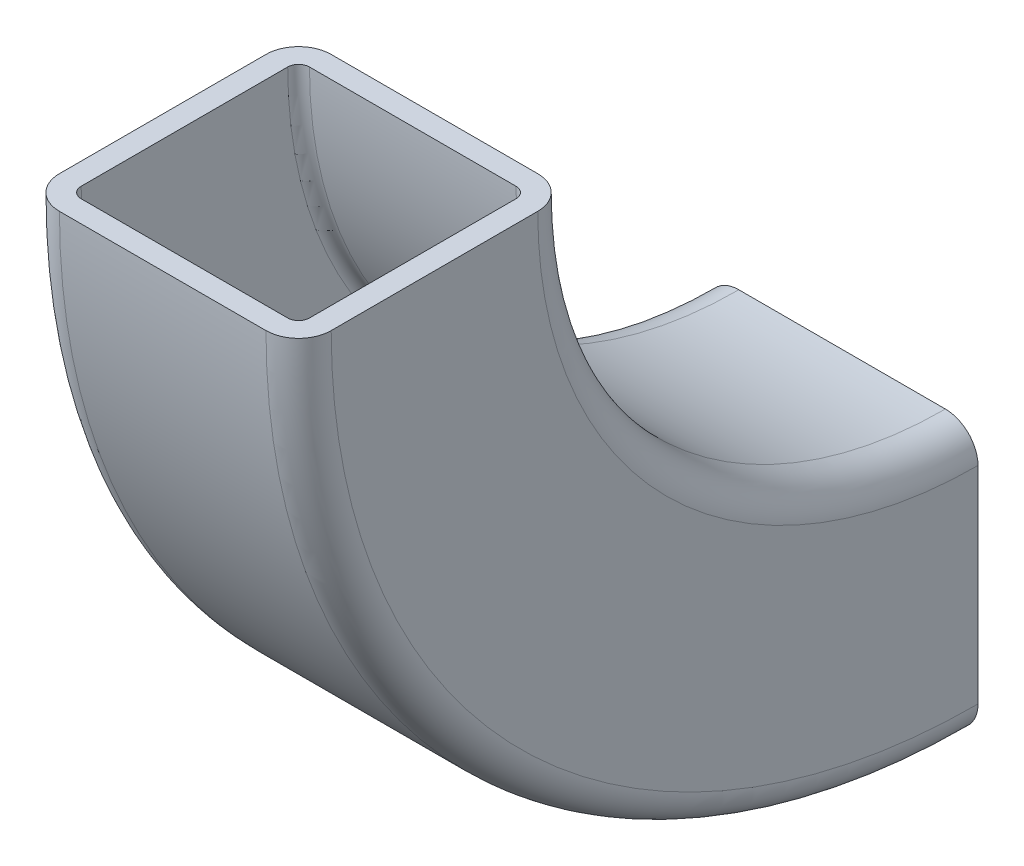
ISO-10303-21;
HEADER;
FILE_DESCRIPTION(('STEP AP214'),'2;1');
FILE_NAME('part.step','',(''),(''),'','','');
FILE_SCHEMA(('AUTOMOTIVE_DESIGN { 1 0 10303 214 1 1 1 1 }'));
ENDSEC;
DATA;
#1=APPLICATION_CONTEXT('core data for automotive mechanical design processes');
#2=APPLICATION_PROTOCOL_DEFINITION('international standard','automotive_design',2000,#1);
#3=PRODUCT_CONTEXT('',#1,'mechanical');
#4=PRODUCT('Part','Part','',(#3));
#5=PRODUCT_RELATED_PRODUCT_CATEGORY('part','',(#4));
#6=PRODUCT_DEFINITION_FORMATION('','',#4);
#7=PRODUCT_DEFINITION_CONTEXT('part definition',#1,'design');
#8=PRODUCT_DEFINITION('design','',#6,#7);
#9=PRODUCT_DEFINITION_SHAPE('','',#8);
#10=(LENGTH_UNIT() NAMED_UNIT(*) SI_UNIT(.MILLI.,.METRE.));
#11=(NAMED_UNIT(*) PLANE_ANGLE_UNIT() SI_UNIT($,.RADIAN.));
#12=(NAMED_UNIT(*) SI_UNIT($,.STERADIAN.) SOLID_ANGLE_UNIT());
#13=UNCERTAINTY_MEASURE_WITH_UNIT(LENGTH_MEASURE(1.E-05),#10,'distance_accuracy_value','');
#14=(GEOMETRIC_REPRESENTATION_CONTEXT(3) GLOBAL_UNCERTAINTY_ASSIGNED_CONTEXT((#13)) GLOBAL_UNIT_ASSIGNED_CONTEXT((#10,
#11,#12)) REPRESENTATION_CONTEXT('',''));
#15=CARTESIAN_POINT('',(0.,0.,0.));
#16=DIRECTION('',(0.,0.,1.));
#17=DIRECTION('',(1.,0.,0.));
#18=AXIS2_PLACEMENT_3D('',#15,#16,#17);
#19=CARTESIAN_POINT('',(0.,0.,0.));
#20=DIRECTION('',(0.,0.,1.));
#21=DIRECTION('',(1.,0.,0.));
#22=AXIS2_PLACEMENT_3D('',#19,#20,#21);
#23=PLANE('',#22);
#24=CARTESIAN_POINT('',(-9.5,-9.5,0.));
#25=DIRECTION('',(0.,0.,-1.));
#26=DIRECTION('',(1.,0.,0.));
#27=AXIS2_PLACEMENT_3D('',#24,#25,#26);
#28=CIRCLE('',#27,3.);
#29=CARTESIAN_POINT('',(-9.5,-12.5,0.));
#30=VERTEX_POINT('',#29);
#31=CARTESIAN_POINT('',(-12.5,-9.5,0.));
#32=VERTEX_POINT('',#31);
#33=EDGE_CURVE('E26',#30,#32,#28,.T.);
#34=ORIENTED_EDGE('',*,*,#33,.T.);
#35=DIRECTION('',(0.,1.,0.));
#36=VECTOR('',#35,1.);
#37=CARTESIAN_POINT('',(-12.5,-9.5,0.));
#38=LINE('',#37,#36);
#39=CARTESIAN_POINT('',(-12.5,9.5,0.));
#40=VERTEX_POINT('',#39);
#41=EDGE_CURVE('E184',#32,#40,#38,.T.);
#42=ORIENTED_EDGE('',*,*,#41,.T.);
#43=CARTESIAN_POINT('',(-9.5,9.5,0.));
#44=DIRECTION('',(0.,0.,-1.));
#45=DIRECTION('',(0.,-1.,0.));
#46=AXIS2_PLACEMENT_3D('',#43,#44,#45);
#47=CIRCLE('',#46,3.);
#48=CARTESIAN_POINT('',(-9.5,12.5,0.));
#49=VERTEX_POINT('',#48);
#50=EDGE_CURVE('E177',#40,#49,#47,.T.);
#51=ORIENTED_EDGE('',*,*,#50,.T.);
#52=DIRECTION('',(1.,0.,0.));
#53=VECTOR('',#52,1.);
#54=CARTESIAN_POINT('',(-9.5,12.5,0.));
#55=LINE('',#54,#53);
#56=CARTESIAN_POINT('',(9.5,12.5,0.));
#57=VERTEX_POINT('',#56);
#58=EDGE_CURVE('E160',#49,#57,#55,.T.);
#59=ORIENTED_EDGE('',*,*,#58,.T.);
#60=CARTESIAN_POINT('',(9.5,9.5,0.));
#61=DIRECTION('',(0.,0.,-1.));
#62=DIRECTION('',(-1.,0.,0.));
#63=AXIS2_PLACEMENT_3D('',#60,#61,#62);
#64=CIRCLE('',#63,3.);
#65=CARTESIAN_POINT('',(12.5,9.5,0.));
#66=VERTEX_POINT('',#65);
#67=EDGE_CURVE('E289',#57,#66,#64,.T.);
#68=ORIENTED_EDGE('',*,*,#67,.T.);
#69=DIRECTION('',(0.,-1.,0.));
#70=VECTOR('',#69,1.);
#71=CARTESIAN_POINT('',(12.5,9.5,0.));
#72=LINE('',#71,#70);
#73=CARTESIAN_POINT('',(12.5,-9.5,0.));
#74=VERTEX_POINT('',#73);
#75=EDGE_CURVE('E204',#66,#74,#72,.T.);
#76=ORIENTED_EDGE('',*,*,#75,.T.);
#77=CARTESIAN_POINT('',(9.5,-9.5,0.));
#78=DIRECTION('',(0.,0.,-1.));
#79=DIRECTION('',(0.,1.,0.));
#80=AXIS2_PLACEMENT_3D('',#77,#78,#79);
#81=CIRCLE('',#80,3.);
#82=CARTESIAN_POINT('',(9.5,-12.5,0.));
#83=VERTEX_POINT('',#82);
#84=EDGE_CURVE('E205',#74,#83,#81,.T.);
#85=ORIENTED_EDGE('',*,*,#84,.T.);
#86=DIRECTION('',(-1.,0.,0.));
#87=VECTOR('',#86,1.);
#88=CARTESIAN_POINT('',(9.5,-12.5,0.));
#89=LINE('',#88,#87);
#90=EDGE_CURVE('E235',#83,#30,#89,.T.);
#91=ORIENTED_EDGE('',*,*,#90,.T.);
#92=EDGE_LOOP('',(#34,#42,#51,#59,#68,#76,#85,#91));
#93=FACE_BOUND('',#92,.T.);
#94=DIRECTION('',(-1.,0.,0.));
#95=VECTOR('',#94,1.);
#96=CARTESIAN_POINT('',(0.,10.5,0.));
#97=LINE('',#96,#95);
#98=CARTESIAN_POINT('',(9.5,10.5,0.));
#99=VERTEX_POINT('',#98);
#100=CARTESIAN_POINT('',(-9.5,10.5,0.));
#101=VERTEX_POINT('',#100);
#102=EDGE_CURVE('E220',#99,#101,#97,.T.);
#103=ORIENTED_EDGE('',*,*,#102,.T.);
#104=CARTESIAN_POINT('',(-9.5,9.5,0.));
#105=DIRECTION('',(0.,0.,1.));
#106=DIRECTION('',(0.,-1.,0.));
#107=AXIS2_PLACEMENT_3D('',#104,#105,#106);
#108=CIRCLE('',#107,1.);
#109=CARTESIAN_POINT('',(-10.5,9.5,0.));
#110=VERTEX_POINT('',#109);
#111=EDGE_CURVE('E226',#101,#110,#108,.T.);
#112=ORIENTED_EDGE('',*,*,#111,.T.);
#113=DIRECTION('',(0.,-1.,0.));
#114=VECTOR('',#113,1.);
#115=CARTESIAN_POINT('',(-10.5,4.75,0.));
#116=LINE('',#115,#114);
#117=CARTESIAN_POINT('',(-10.5,-9.5,0.));
#118=VERTEX_POINT('',#117);
#119=EDGE_CURVE('E114',#110,#118,#116,.T.);
#120=ORIENTED_EDGE('',*,*,#119,.T.);
#121=CARTESIAN_POINT('',(-9.5,-9.5,0.));
#122=DIRECTION('',(0.,0.,1.));
#123=DIRECTION('',(0.,-1.,0.));
#124=AXIS2_PLACEMENT_3D('',#121,#122,#123);
#125=CIRCLE('',#124,1.);
#126=CARTESIAN_POINT('',(-9.5,-10.5,0.));
#127=VERTEX_POINT('',#126);
#128=EDGE_CURVE('E210',#118,#127,#125,.T.);
#129=ORIENTED_EDGE('',*,*,#128,.T.);
#130=DIRECTION('',(1.,0.,0.));
#131=VECTOR('',#130,1.);
#132=CARTESIAN_POINT('',(0.,-10.5,0.));
#133=LINE('',#132,#131);
#134=CARTESIAN_POINT('',(9.5,-10.5,0.));
#135=VERTEX_POINT('',#134);
#136=EDGE_CURVE('E225',#127,#135,#133,.T.);
#137=ORIENTED_EDGE('',*,*,#136,.T.);
#138=CARTESIAN_POINT('',(9.5,-9.5,0.));
#139=DIRECTION('',(0.,0.,1.));
#140=DIRECTION('',(0.,-1.,0.));
#141=AXIS2_PLACEMENT_3D('',#138,#139,#140);
#142=CIRCLE('',#141,1.);
#143=CARTESIAN_POINT('',(10.5,-9.5,0.));
#144=VERTEX_POINT('',#143);
#145=EDGE_CURVE('E243',#135,#144,#142,.T.);
#146=ORIENTED_EDGE('',*,*,#145,.T.);
#147=DIRECTION('',(0.,1.,0.));
#148=VECTOR('',#147,1.);
#149=CARTESIAN_POINT('',(10.5,-4.75,0.));
#150=LINE('',#149,#148);
#151=CARTESIAN_POINT('',(10.5,9.5,0.));
#152=VERTEX_POINT('',#151);
#153=EDGE_CURVE('E247',#144,#152,#150,.T.);
#154=ORIENTED_EDGE('',*,*,#153,.T.);
#155=CARTESIAN_POINT('',(9.5,9.5,0.));
#156=DIRECTION('',(0.,0.,1.));
#157=DIRECTION('',(0.,-1.,0.));
#158=AXIS2_PLACEMENT_3D('',#155,#156,#157);
#159=CIRCLE('',#158,1.);
#160=EDGE_CURVE('E242',#152,#99,#159,.T.);
#161=ORIENTED_EDGE('',*,*,#160,.T.);
#162=EDGE_LOOP('',(#103,#112,#120,#129,#137,#146,#154,#161));
#163=FACE_BOUND('',#162,.T.);
#164=ADVANCED_FACE('F16',(#93,#163),#23,.F.);
#165=CARTESIAN_POINT('',(0.,50.,50.));
#166=DIRECTION('',(0.,1.,0.));
#167=DIRECTION('',(0.,0.,-1.));
#168=AXIS2_PLACEMENT_3D('',#165,#166,#167);
#169=PLANE('',#168);
#170=CARTESIAN_POINT('',(-9.5,50.,59.5));
#171=DIRECTION('',(0.,1.,0.));
#172=DIRECTION('',(1.,0.,0.));
#173=AXIS2_PLACEMENT_3D('',#170,#171,#172);
#174=CIRCLE('',#173,3.);
#175=CARTESIAN_POINT('',(-12.5,50.,59.5));
#176=VERTEX_POINT('',#175);
#177=CARTESIAN_POINT('',(-9.5,50.,62.5));
#178=VERTEX_POINT('',#177);
#179=EDGE_CURVE('E11',#176,#178,#174,.T.);
#180=ORIENTED_EDGE('',*,*,#179,.T.);
#181=DIRECTION('',(1.,0.,0.));
#182=VECTOR('',#181,1.);
#183=CARTESIAN_POINT('',(9.5,50.,62.5));
#184=LINE('',#183,#182);
#185=CARTESIAN_POINT('',(9.5,50.,62.5));
#186=VERTEX_POINT('',#185);
#187=EDGE_CURVE('E262',#178,#186,#184,.T.);
#188=ORIENTED_EDGE('',*,*,#187,.T.);
#189=CARTESIAN_POINT('',(9.5,50.,59.5));
#190=DIRECTION('',(0.,1.,0.));
#191=DIRECTION('',(0.,0.,-1.));
#192=AXIS2_PLACEMENT_3D('',#189,#190,#191);
#193=CIRCLE('',#192,3.);
#194=CARTESIAN_POINT('',(12.5,50.,59.5));
#195=VERTEX_POINT('',#194);
#196=EDGE_CURVE('E209',#186,#195,#193,.T.);
#197=ORIENTED_EDGE('',*,*,#196,.T.);
#198=DIRECTION('',(0.,0.,-1.));
#199=VECTOR('',#198,1.);
#200=CARTESIAN_POINT('',(12.5,50.,40.5));
#201=LINE('',#200,#199);
#202=CARTESIAN_POINT('',(12.5,50.,40.5));
#203=VERTEX_POINT('',#202);
#204=EDGE_CURVE('E200',#195,#203,#201,.T.);
#205=ORIENTED_EDGE('',*,*,#204,.T.);
#206=CARTESIAN_POINT('',(9.5,50.,40.5));
#207=DIRECTION('',(0.,1.,0.));
#208=DIRECTION('',(-1.,0.,0.));
#209=AXIS2_PLACEMENT_3D('',#206,#207,#208);
#210=CIRCLE('',#209,3.);
#211=CARTESIAN_POINT('',(9.5,50.,37.5));
#212=VERTEX_POINT('',#211);
#213=EDGE_CURVE('E270',#203,#212,#210,.T.);
#214=ORIENTED_EDGE('',*,*,#213,.T.);
#215=DIRECTION('',(-1.,0.,0.));
#216=VECTOR('',#215,1.);
#217=CARTESIAN_POINT('',(-9.5,50.,37.5));
#218=LINE('',#217,#216);
#219=CARTESIAN_POINT('',(-9.5,50.,37.5));
#220=VERTEX_POINT('',#219);
#221=EDGE_CURVE('E172',#212,#220,#218,.T.);
#222=ORIENTED_EDGE('',*,*,#221,.T.);
#223=CARTESIAN_POINT('',(-9.5,50.,40.5));
#224=DIRECTION('',(0.,1.,0.));
#225=DIRECTION('',(0.,0.,1.));
#226=AXIS2_PLACEMENT_3D('',#223,#224,#225);
#227=CIRCLE('',#226,3.);
#228=CARTESIAN_POINT('',(-12.5,50.,40.5));
#229=VERTEX_POINT('',#228);
#230=EDGE_CURVE('E179',#220,#229,#227,.T.);
#231=ORIENTED_EDGE('',*,*,#230,.T.);
#232=DIRECTION('',(0.,0.,1.));
#233=VECTOR('',#232,1.);
#234=CARTESIAN_POINT('',(-12.5,50.,59.5));
#235=LINE('',#234,#233);
#236=EDGE_CURVE('E194',#229,#176,#235,.T.);
#237=ORIENTED_EDGE('',*,*,#236,.T.);
#238=EDGE_LOOP('',(#180,#188,#197,#205,#214,#222,#231,#237));
#239=FACE_BOUND('',#238,.T.);
#240=DIRECTION('',(1.,0.,0.));
#241=VECTOR('',#240,1.);
#242=CARTESIAN_POINT('',(0.,50.,39.5));
#243=LINE('',#242,#241);
#244=CARTESIAN_POINT('',(-9.5,50.,39.5));
#245=VERTEX_POINT('',#244);
#246=CARTESIAN_POINT('',(9.5,50.,39.5));
#247=VERTEX_POINT('',#246);
#248=EDGE_CURVE('E219',#245,#247,#243,.T.);
#249=ORIENTED_EDGE('',*,*,#248,.T.);
#250=CARTESIAN_POINT('',(9.5,50.,40.5));
#251=DIRECTION('',(0.,-1.,0.));
#252=DIRECTION('',(0.,0.,1.));
#253=AXIS2_PLACEMENT_3D('',#250,#251,#252);
#254=CIRCLE('',#253,1.);
#255=CARTESIAN_POINT('',(10.5,50.,40.5));
#256=VERTEX_POINT('',#255);
#257=EDGE_CURVE('E251',#247,#256,#254,.T.);
#258=ORIENTED_EDGE('',*,*,#257,.T.);
#259=DIRECTION('',(0.,0.,1.));
#260=VECTOR('',#259,1.);
#261=CARTESIAN_POINT('',(10.5,50.,25.));
#262=LINE('',#261,#260);
#263=CARTESIAN_POINT('',(10.5,50.,59.5));
#264=VERTEX_POINT('',#263);
#265=EDGE_CURVE('E246',#256,#264,#262,.T.);
#266=ORIENTED_EDGE('',*,*,#265,.T.);
#267=CARTESIAN_POINT('',(9.5,50.,59.5));
#268=DIRECTION('',(0.,-1.,0.));
#269=DIRECTION('',(0.,0.,1.));
#270=AXIS2_PLACEMENT_3D('',#267,#268,#269);
#271=CIRCLE('',#270,1.);
#272=CARTESIAN_POINT('',(9.5,50.,60.5));
#273=VERTEX_POINT('',#272);
#274=EDGE_CURVE('E317',#264,#273,#271,.T.);
#275=ORIENTED_EDGE('',*,*,#274,.T.);
#276=DIRECTION('',(-1.,0.,0.));
#277=VECTOR('',#276,1.);
#278=CARTESIAN_POINT('',(0.,50.,60.5));
#279=LINE('',#278,#277);
#280=CARTESIAN_POINT('',(-9.5,50.,60.5));
#281=VERTEX_POINT('',#280);
#282=EDGE_CURVE('E214',#273,#281,#279,.T.);
#283=ORIENTED_EDGE('',*,*,#282,.T.);
#284=CARTESIAN_POINT('',(-9.5,50.,59.5));
#285=DIRECTION('',(0.,-1.,0.));
#286=DIRECTION('',(0.,0.,1.));
#287=AXIS2_PLACEMENT_3D('',#284,#285,#286);
#288=CIRCLE('',#287,1.);
#289=CARTESIAN_POINT('',(-10.5,50.,59.5));
#290=VERTEX_POINT('',#289);
#291=EDGE_CURVE('E126',#281,#290,#288,.T.);
#292=ORIENTED_EDGE('',*,*,#291,.T.);
#293=DIRECTION('',(0.,0.,-1.));
#294=VECTOR('',#293,1.);
#295=CARTESIAN_POINT('',(-10.5,50.,25.));
#296=LINE('',#295,#294);
#297=CARTESIAN_POINT('',(-10.5,50.,40.5));
#298=VERTEX_POINT('',#297);
#299=EDGE_CURVE('E229',#290,#298,#296,.T.);
#300=ORIENTED_EDGE('',*,*,#299,.T.);
#301=CARTESIAN_POINT('',(-9.5,50.,40.5));
#302=DIRECTION('',(0.,-1.,0.));
#303=DIRECTION('',(0.,0.,1.));
#304=AXIS2_PLACEMENT_3D('',#301,#302,#303);
#305=CIRCLE('',#304,1.);
#306=EDGE_CURVE('E228',#298,#245,#305,.T.);
#307=ORIENTED_EDGE('',*,*,#306,.T.);
#308=EDGE_LOOP('',(#249,#258,#266,#275,#283,#292,#300,#307));
#309=FACE_BOUND('',#308,.T.);
#310=ADVANCED_FACE('F351',(#239,#309),#169,.T.);
#311=CARTESIAN_POINT('',(-9.5,50.,0.));
#312=DIRECTION('',(-1.,0.,0.));
#313=DIRECTION('',(0.,0.,1.));
#314=AXIS2_PLACEMENT_3D('',#311,#312,#313);
#315=TOROIDAL_SURFACE('',#314,59.5,3.);
#316=ORIENTED_EDGE('',*,*,#33,.F.);
#317=CARTESIAN_POINT('',(-9.5,50.,0.));
#318=DIRECTION('',(-1.,0.,0.));
#319=DIRECTION('',(0.,-1.,0.));
#320=AXIS2_PLACEMENT_3D('',#317,#318,#319);
#321=CIRCLE('',#320,62.5);
#322=EDGE_CURVE('E265',#30,#178,#321,.T.);
#323=ORIENTED_EDGE('',*,*,#322,.T.);
#324=ORIENTED_EDGE('',*,*,#179,.F.);
#325=CARTESIAN_POINT('',(-12.5,50.,0.));
#326=DIRECTION('',(-1.,0.,0.));
#327=DIRECTION('',(0.,-1.,0.));
#328=AXIS2_PLACEMENT_3D('',#325,#326,#327);
#329=CIRCLE('',#328,59.5);
#330=EDGE_CURVE('E299',#32,#176,#329,.T.);
#331=ORIENTED_EDGE('',*,*,#330,.F.);
#332=EDGE_LOOP('',(#316,#323,#324,#331));
#333=FACE_BOUND('',#332,.T.);
#334=ADVANCED_FACE('F348',(#333),#315,.T.);
#335=CARTESIAN_POINT('',(0.,50.,0.));
#336=DIRECTION('',(-1.,0.,0.));
#337=DIRECTION('',(0.,-1.,0.));
#338=AXIS2_PLACEMENT_3D('',#335,#336,#337);
#339=CYLINDRICAL_SURFACE('',#338,62.5);
#340=ORIENTED_EDGE('',*,*,#90,.F.);
#341=CARTESIAN_POINT('',(9.5,50.,0.));
#342=DIRECTION('',(-1.,0.,0.));
#343=DIRECTION('',(0.,-1.,0.));
#344=AXIS2_PLACEMENT_3D('',#341,#342,#343);
#345=CIRCLE('',#344,62.5);
#346=EDGE_CURVE('E231',#83,#186,#345,.T.);
#347=ORIENTED_EDGE('',*,*,#346,.T.);
#348=ORIENTED_EDGE('',*,*,#187,.F.);
#349=ORIENTED_EDGE('',*,*,#322,.F.);
#350=EDGE_LOOP('',(#340,#347,#348,#349));
#351=FACE_BOUND('',#350,.T.);
#352=ADVANCED_FACE('F405',(#351),#339,.T.);
#353=CARTESIAN_POINT('',(9.5,50.,0.));
#354=DIRECTION('',(-1.,0.,0.));
#355=DIRECTION('',(0.,0.,1.));
#356=AXIS2_PLACEMENT_3D('',#353,#354,#355);
#357=TOROIDAL_SURFACE('',#356,59.5,3.);
#358=ORIENTED_EDGE('',*,*,#84,.F.);
#359=CARTESIAN_POINT('',(12.5,50.,0.));
#360=DIRECTION('',(-1.,0.,0.));
#361=DIRECTION('',(0.,-1.,0.));
#362=AXIS2_PLACEMENT_3D('',#359,#360,#361);
#363=CIRCLE('',#362,59.5);
#364=EDGE_CURVE('E203',#74,#195,#363,.T.);
#365=ORIENTED_EDGE('',*,*,#364,.T.);
#366=ORIENTED_EDGE('',*,*,#196,.F.);
#367=ORIENTED_EDGE('',*,*,#346,.F.);
#368=EDGE_LOOP('',(#358,#365,#366,#367));
#369=FACE_BOUND('',#368,.T.);
#370=ADVANCED_FACE('F419',(#369),#357,.T.);
#371=CARTESIAN_POINT('',(12.5,-9.5,0.));
#372=DIRECTION('',(1.,0.,0.));
#373=DIRECTION('',(0.,0.,1.));
#374=AXIS2_PLACEMENT_3D('',#371,#372,#373);
#375=PLANE('',#374);
#376=ORIENTED_EDGE('',*,*,#75,.F.);
#377=CARTESIAN_POINT('',(12.5,50.,0.));
#378=DIRECTION('',(-1.,0.,0.));
#379=DIRECTION('',(0.,-1.,0.));
#380=AXIS2_PLACEMENT_3D('',#377,#378,#379);
#381=CIRCLE('',#380,40.5);
#382=EDGE_CURVE('E266',#66,#203,#381,.T.);
#383=ORIENTED_EDGE('',*,*,#382,.T.);
#384=ORIENTED_EDGE('',*,*,#204,.F.);
#385=ORIENTED_EDGE('',*,*,#364,.F.);
#386=EDGE_LOOP('',(#376,#383,#384,#385));
#387=FACE_BOUND('',#386,.T.);
#388=ADVANCED_FACE('F409',(#387),#375,.T.);
#389=CARTESIAN_POINT('',(9.5,50.,0.));
#390=DIRECTION('',(-1.,0.,0.));
#391=DIRECTION('',(0.,0.,1.));
#392=AXIS2_PLACEMENT_3D('',#389,#390,#391);
#393=TOROIDAL_SURFACE('',#392,40.5,3.);
#394=ORIENTED_EDGE('',*,*,#67,.F.);
#395=CARTESIAN_POINT('',(9.5,50.,0.));
#396=DIRECTION('',(-1.,0.,0.));
#397=DIRECTION('',(0.,-1.,0.));
#398=AXIS2_PLACEMENT_3D('',#395,#396,#397);
#399=CIRCLE('',#398,37.5);
#400=EDGE_CURVE('E167',#57,#212,#399,.T.);
#401=ORIENTED_EDGE('',*,*,#400,.T.);
#402=ORIENTED_EDGE('',*,*,#213,.F.);
#403=ORIENTED_EDGE('',*,*,#382,.F.);
#404=EDGE_LOOP('',(#394,#401,#402,#403));
#405=FACE_BOUND('',#404,.T.);
#406=ADVANCED_FACE('F356',(#405),#393,.T.);
#407=CARTESIAN_POINT('',(0.,50.,0.));
#408=DIRECTION('',(-1.,0.,0.));
#409=DIRECTION('',(0.,-1.,0.));
#410=AXIS2_PLACEMENT_3D('',#407,#408,#409);
#411=CYLINDRICAL_SURFACE('',#410,37.5);
#412=ORIENTED_EDGE('',*,*,#58,.F.);
#413=CARTESIAN_POINT('',(-9.5,50.,0.));
#414=DIRECTION('',(-1.,0.,0.));
#415=DIRECTION('',(0.,-1.,0.));
#416=AXIS2_PLACEMENT_3D('',#413,#414,#415);
#417=CIRCLE('',#416,37.5);
#418=EDGE_CURVE('E164',#49,#220,#417,.T.);
#419=ORIENTED_EDGE('',*,*,#418,.T.);
#420=ORIENTED_EDGE('',*,*,#221,.F.);
#421=ORIENTED_EDGE('',*,*,#400,.F.);
#422=EDGE_LOOP('',(#412,#419,#420,#421));
#423=FACE_BOUND('',#422,.T.);
#424=ADVANCED_FACE('F162',(#423),#411,.F.);
#425=CARTESIAN_POINT('',(-9.5,50.,0.));
#426=DIRECTION('',(-1.,0.,0.));
#427=DIRECTION('',(0.,0.,1.));
#428=AXIS2_PLACEMENT_3D('',#425,#426,#427);
#429=TOROIDAL_SURFACE('',#428,40.5,3.);
#430=ORIENTED_EDGE('',*,*,#50,.F.);
#431=CARTESIAN_POINT('',(-12.5,50.,0.));
#432=DIRECTION('',(-1.,0.,0.));
#433=DIRECTION('',(0.,-1.,0.));
#434=AXIS2_PLACEMENT_3D('',#431,#432,#433);
#435=CIRCLE('',#434,40.5);
#436=EDGE_CURVE('E186',#40,#229,#435,.T.);
#437=ORIENTED_EDGE('',*,*,#436,.T.);
#438=ORIENTED_EDGE('',*,*,#230,.F.);
#439=ORIENTED_EDGE('',*,*,#418,.F.);
#440=EDGE_LOOP('',(#430,#437,#438,#439));
#441=FACE_BOUND('',#440,.T.);
#442=ADVANCED_FACE('F175',(#441),#429,.T.);
#443=CARTESIAN_POINT('',(-12.5,9.5,0.));
#444=DIRECTION('',(-1.,0.,0.));
#445=DIRECTION('',(0.,0.,1.));
#446=AXIS2_PLACEMENT_3D('',#443,#444,#445);
#447=PLANE('',#446);
#448=ORIENTED_EDGE('',*,*,#41,.F.);
#449=ORIENTED_EDGE('',*,*,#330,.T.);
#450=ORIENTED_EDGE('',*,*,#236,.F.);
#451=ORIENTED_EDGE('',*,*,#436,.F.);
#452=EDGE_LOOP('',(#448,#449,#450,#451));
#453=FACE_BOUND('',#452,.T.);
#454=ADVANCED_FACE('F346',(#453),#447,.T.);
#455=CARTESIAN_POINT('',(-9.5,50.,0.));
#456=DIRECTION('',(-1.,0.,0.));
#457=DIRECTION('',(0.,0.,1.));
#458=AXIS2_PLACEMENT_3D('',#455,#456,#457);
#459=TOROIDAL_SURFACE('',#458,40.5,1.);
#460=ORIENTED_EDGE('',*,*,#111,.F.);
#461=CARTESIAN_POINT('',(-9.5,50.,0.));
#462=DIRECTION('',(-1.,0.,0.));
#463=DIRECTION('',(0.,-1.,0.));
#464=AXIS2_PLACEMENT_3D('',#461,#462,#463);
#465=CIRCLE('',#464,39.5);
#466=EDGE_CURVE('E238',#101,#245,#465,.T.);
#467=ORIENTED_EDGE('',*,*,#466,.T.);
#468=ORIENTED_EDGE('',*,*,#306,.F.);
#469=CARTESIAN_POINT('',(-10.5,50.,0.));
#470=DIRECTION('',(-1.,0.,0.));
#471=DIRECTION('',(0.,-1.,0.));
#472=AXIS2_PLACEMENT_3D('',#469,#470,#471);
#473=CIRCLE('',#472,40.5);
#474=EDGE_CURVE('E271',#110,#298,#473,.T.);
#475=ORIENTED_EDGE('',*,*,#474,.F.);
#476=EDGE_LOOP('',(#460,#467,#468,#475));
#477=FACE_BOUND('',#476,.T.);
#478=ADVANCED_FACE('F380',(#477),#459,.F.);
#479=CARTESIAN_POINT('',(-10.5,9.5,0.));
#480=DIRECTION('',(-1.,0.,0.));
#481=DIRECTION('',(0.,0.,1.));
#482=AXIS2_PLACEMENT_3D('',#479,#480,#481);
#483=PLANE('',#482);
#484=ORIENTED_EDGE('',*,*,#119,.F.);
#485=ORIENTED_EDGE('',*,*,#474,.T.);
#486=ORIENTED_EDGE('',*,*,#299,.F.);
#487=CARTESIAN_POINT('',(-10.5,50.,0.));
#488=DIRECTION('',(-1.,0.,0.));
#489=DIRECTION('',(0.,-1.,0.));
#490=AXIS2_PLACEMENT_3D('',#487,#488,#489);
#491=CIRCLE('',#490,59.5);
#492=EDGE_CURVE('E213',#118,#290,#491,.T.);
#493=ORIENTED_EDGE('',*,*,#492,.F.);
#494=EDGE_LOOP('',(#484,#485,#486,#493));
#495=FACE_BOUND('',#494,.T.);
#496=ADVANCED_FACE('F383',(#495),#483,.F.);
#497=CARTESIAN_POINT('',(-9.5,50.,0.));
#498=DIRECTION('',(-1.,0.,0.));
#499=DIRECTION('',(0.,0.,1.));
#500=AXIS2_PLACEMENT_3D('',#497,#498,#499);
#501=TOROIDAL_SURFACE('',#500,59.5,1.);
#502=ORIENTED_EDGE('',*,*,#128,.F.);
#503=ORIENTED_EDGE('',*,*,#492,.T.);
#504=ORIENTED_EDGE('',*,*,#291,.F.);
#505=CARTESIAN_POINT('',(-9.5,50.,0.));
#506=DIRECTION('',(-1.,0.,0.));
#507=DIRECTION('',(0.,-1.,0.));
#508=AXIS2_PLACEMENT_3D('',#505,#506,#507);
#509=CIRCLE('',#508,60.5);
#510=EDGE_CURVE('E221',#127,#281,#509,.T.);
#511=ORIENTED_EDGE('',*,*,#510,.F.);
#512=EDGE_LOOP('',(#502,#503,#504,#511));
#513=FACE_BOUND('',#512,.T.);
#514=ADVANCED_FACE('F385',(#513),#501,.F.);
#515=CARTESIAN_POINT('',(0.,50.,0.));
#516=DIRECTION('',(-1.,0.,0.));
#517=DIRECTION('',(0.,-1.,0.));
#518=AXIS2_PLACEMENT_3D('',#515,#516,#517);
#519=CYLINDRICAL_SURFACE('',#518,60.5);
#520=ORIENTED_EDGE('',*,*,#136,.F.);
#521=ORIENTED_EDGE('',*,*,#510,.T.);
#522=ORIENTED_EDGE('',*,*,#282,.F.);
#523=CARTESIAN_POINT('',(9.5,50.,0.));
#524=DIRECTION('',(-1.,0.,0.));
#525=DIRECTION('',(0.,-1.,0.));
#526=AXIS2_PLACEMENT_3D('',#523,#524,#525);
#527=CIRCLE('',#526,60.5);
#528=EDGE_CURVE('E198',#135,#273,#527,.T.);
#529=ORIENTED_EDGE('',*,*,#528,.F.);
#530=EDGE_LOOP('',(#520,#521,#522,#529));
#531=FACE_BOUND('',#530,.T.);
#532=ADVANCED_FACE('F18',(#531),#519,.F.);
#533=CARTESIAN_POINT('',(9.5,50.,0.));
#534=DIRECTION('',(-1.,0.,0.));
#535=DIRECTION('',(0.,0.,1.));
#536=AXIS2_PLACEMENT_3D('',#533,#534,#535);
#537=TOROIDAL_SURFACE('',#536,59.5,1.);
#538=ORIENTED_EDGE('',*,*,#145,.F.);
#539=ORIENTED_EDGE('',*,*,#528,.T.);
#540=ORIENTED_EDGE('',*,*,#274,.F.);
#541=CARTESIAN_POINT('',(10.5,50.,0.));
#542=DIRECTION('',(-1.,0.,0.));
#543=DIRECTION('',(0.,-1.,0.));
#544=AXIS2_PLACEMENT_3D('',#541,#542,#543);
#545=CIRCLE('',#544,59.5);
#546=EDGE_CURVE('E250',#144,#264,#545,.T.);
#547=ORIENTED_EDGE('',*,*,#546,.F.);
#548=EDGE_LOOP('',(#538,#539,#540,#547));
#549=FACE_BOUND('',#548,.T.);
#550=ADVANCED_FACE('F394',(#549),#537,.F.);
#551=CARTESIAN_POINT('',(10.5,-9.5,0.));
#552=DIRECTION('',(1.,0.,0.));
#553=DIRECTION('',(0.,0.,1.));
#554=AXIS2_PLACEMENT_3D('',#551,#552,#553);
#555=PLANE('',#554);
#556=ORIENTED_EDGE('',*,*,#153,.F.);
#557=ORIENTED_EDGE('',*,*,#546,.T.);
#558=ORIENTED_EDGE('',*,*,#265,.F.);
#559=CARTESIAN_POINT('',(10.5,50.,0.));
#560=DIRECTION('',(-1.,0.,0.));
#561=DIRECTION('',(0.,-1.,0.));
#562=AXIS2_PLACEMENT_3D('',#559,#560,#561);
#563=CIRCLE('',#562,40.5);
#564=EDGE_CURVE('E309',#152,#256,#563,.T.);
#565=ORIENTED_EDGE('',*,*,#564,.F.);
#566=EDGE_LOOP('',(#556,#557,#558,#565));
#567=FACE_BOUND('',#566,.T.);
#568=ADVANCED_FACE('F397',(#567),#555,.F.);
#569=CARTESIAN_POINT('',(9.5,50.,0.));
#570=DIRECTION('',(-1.,0.,0.));
#571=DIRECTION('',(0.,0.,1.));
#572=AXIS2_PLACEMENT_3D('',#569,#570,#571);
#573=TOROIDAL_SURFACE('',#572,40.5,1.);
#574=ORIENTED_EDGE('',*,*,#160,.F.);
#575=ORIENTED_EDGE('',*,*,#564,.T.);
#576=ORIENTED_EDGE('',*,*,#257,.F.);
#577=CARTESIAN_POINT('',(9.5,50.,0.));
#578=DIRECTION('',(-1.,0.,0.));
#579=DIRECTION('',(0.,-1.,0.));
#580=AXIS2_PLACEMENT_3D('',#577,#578,#579);
#581=CIRCLE('',#580,39.5);
#582=EDGE_CURVE('E215',#99,#247,#581,.T.);
#583=ORIENTED_EDGE('',*,*,#582,.F.);
#584=EDGE_LOOP('',(#574,#575,#576,#583));
#585=FACE_BOUND('',#584,.T.);
#586=ADVANCED_FACE('F374',(#585),#573,.F.);
#587=CARTESIAN_POINT('',(0.,50.,0.));
#588=DIRECTION('',(-1.,0.,0.));
#589=DIRECTION('',(0.,-1.,0.));
#590=AXIS2_PLACEMENT_3D('',#587,#588,#589);
#591=CYLINDRICAL_SURFACE('',#590,39.5);
#592=ORIENTED_EDGE('',*,*,#102,.F.);
#593=ORIENTED_EDGE('',*,*,#582,.T.);
#594=ORIENTED_EDGE('',*,*,#248,.F.);
#595=ORIENTED_EDGE('',*,*,#466,.F.);
#596=EDGE_LOOP('',(#592,#593,#594,#595));
#597=FACE_BOUND('',#596,.T.);
#598=ADVANCED_FACE('F378',(#597),#591,.T.);
#599=CLOSED_SHELL('',(#164,#310,#334,#352,#370,#388,#406,#424,#442,#454,#478,#496,#514,#532,
#550,#568,#586,#598));
#600=MANIFOLD_SOLID_BREP('B1',#599);
#601=ADVANCED_BREP_SHAPE_REPRESENTATION('',(#18,#600),#14);
#602=SHAPE_DEFINITION_REPRESENTATION(#9,#601);
ENDSEC;
END-ISO-10303-21;
